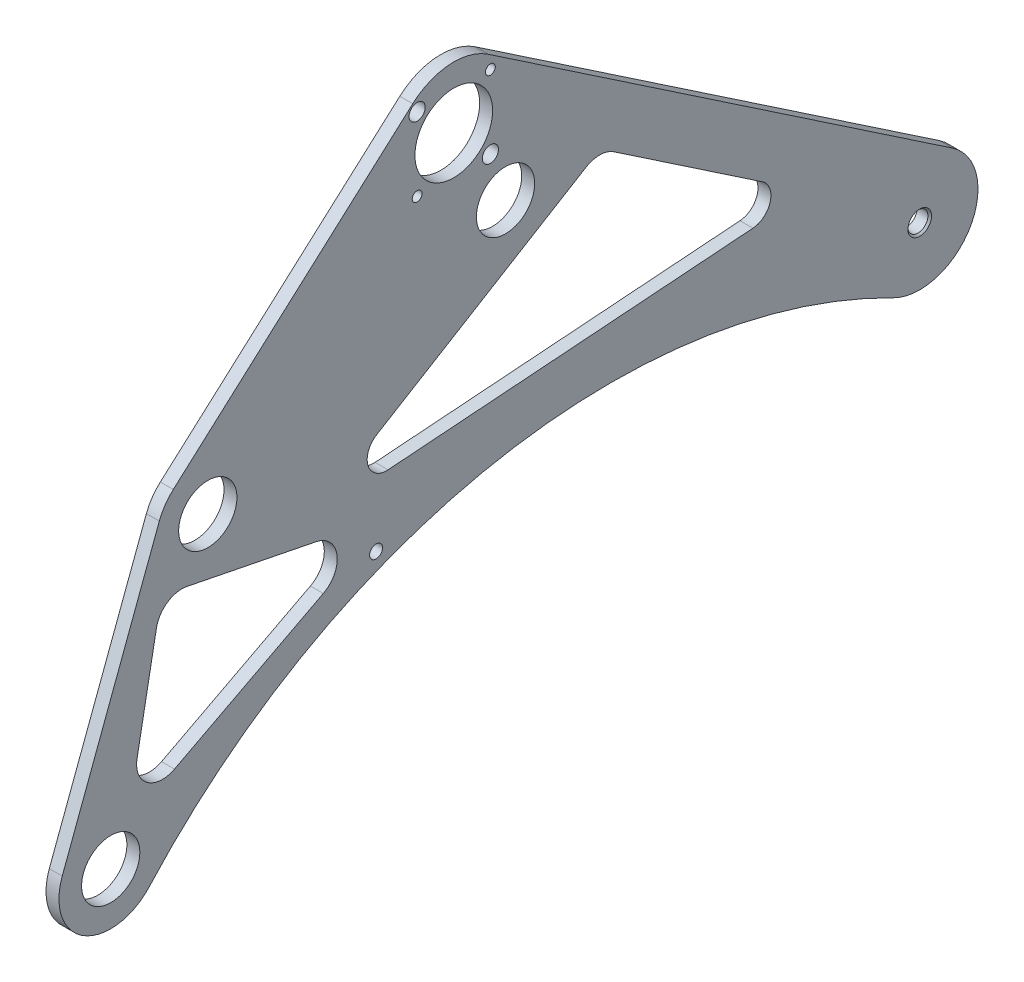
ISO-10303-21;
HEADER;
FILE_DESCRIPTION(('STEP AP214'),'2;1');
FILE_NAME('part.step','',(''),(''),'','','');
FILE_SCHEMA(('AUTOMOTIVE_DESIGN { 1 0 10303 214 1 1 1 1 }'));
ENDSEC;
DATA;
#1=APPLICATION_CONTEXT('core data for automotive mechanical design processes');
#2=APPLICATION_PROTOCOL_DEFINITION('international standard','automotive_design',2000,#1);
#3=PRODUCT_CONTEXT('',#1,'mechanical');
#4=PRODUCT('Part','Part','',(#3));
#5=PRODUCT_RELATED_PRODUCT_CATEGORY('part','',(#4));
#6=PRODUCT_DEFINITION_FORMATION('','',#4);
#7=PRODUCT_DEFINITION_CONTEXT('part definition',#1,'design');
#8=PRODUCT_DEFINITION('design','',#6,#7);
#9=PRODUCT_DEFINITION_SHAPE('','',#8);
#10=(LENGTH_UNIT() NAMED_UNIT(*) SI_UNIT(.MILLI.,.METRE.));
#11=(NAMED_UNIT(*) PLANE_ANGLE_UNIT() SI_UNIT($,.RADIAN.));
#12=(NAMED_UNIT(*) SI_UNIT($,.STERADIAN.) SOLID_ANGLE_UNIT());
#13=UNCERTAINTY_MEASURE_WITH_UNIT(LENGTH_MEASURE(1.E-05),#10,'distance_accuracy_value','');
#14=(GEOMETRIC_REPRESENTATION_CONTEXT(3) GLOBAL_UNCERTAINTY_ASSIGNED_CONTEXT((#13)) GLOBAL_UNIT_ASSIGNED_CONTEXT((#10,
#11,#12)) REPRESENTATION_CONTEXT('',''));
#15=CARTESIAN_POINT('',(0.,0.,0.));
#16=DIRECTION('',(0.,0.,1.));
#17=DIRECTION('',(1.,0.,0.));
#18=AXIS2_PLACEMENT_3D('',#15,#16,#17);
#19=CARTESIAN_POINT('',(6.35,0.,0.));
#20=DIRECTION('',(-1.,0.,0.));
#21=DIRECTION('',(0.,0.,1.));
#22=AXIS2_PLACEMENT_3D('',#19,#20,#21);
#23=CYLINDRICAL_SURFACE('',#22,28.575);
#24=CARTESIAN_POINT('',(0.,0.,0.));
#25=DIRECTION('',(1.,0.,0.));
#26=DIRECTION('',(0.,0.,-1.));
#27=AXIS2_PLACEMENT_3D('',#24,#25,#26);
#28=CIRCLE('',#27,28.575);
#29=CARTESIAN_POINT('',(0.,-25.4592346242806,12.9752840949953));
#30=VERTEX_POINT('',#29);
#31=CARTESIAN_POINT('',(0.,23.6838537199384,-15.9876733132923));
#32=VERTEX_POINT('',#31);
#33=EDGE_CURVE('E412',#30,#32,#28,.T.);
#34=ORIENTED_EDGE('',*,*,#33,.T.);
#35=DIRECTION('',(-1.,0.,0.));
#36=VECTOR('',#35,1.);
#37=CARTESIAN_POINT('',(6.35,23.6838537199384,-15.9876733132923));
#38=LINE('',#37,#36);
#39=CARTESIAN_POINT('',(6.35,23.6838537199384,-15.9876733132923));
#40=VERTEX_POINT('',#39);
#41=EDGE_CURVE('E11',#40,#32,#38,.T.);
#42=ORIENTED_EDGE('',*,*,#41,.F.);
#43=CARTESIAN_POINT('',(6.35,0.,0.));
#44=DIRECTION('',(1.,0.,0.));
#45=DIRECTION('',(0.,0.,-1.));
#46=AXIS2_PLACEMENT_3D('',#43,#44,#45);
#47=CIRCLE('',#46,28.575);
#48=CARTESIAN_POINT('',(6.35,-25.4592346242806,12.9752840949953));
#49=VERTEX_POINT('',#48);
#50=EDGE_CURVE('E413',#49,#40,#47,.T.);
#51=ORIENTED_EDGE('',*,*,#50,.F.);
#52=DIRECTION('',(-1.,0.,0.));
#53=VECTOR('',#52,1.);
#54=CARTESIAN_POINT('',(6.35,-25.4592346242806,12.9752840949953));
#55=LINE('',#54,#53);
#56=EDGE_CURVE('E436',#49,#30,#55,.T.);
#57=ORIENTED_EDGE('',*,*,#56,.T.);
#58=EDGE_LOOP('',(#34,#42,#51,#57));
#59=FACE_BOUND('',#58,.T.);
#60=ADVANCED_FACE('F41',(#59),#23,.T.);
#61=CARTESIAN_POINT('',(6.35,177.399623371046,211.724122613747));
#62=DIRECTION('',(0.,-0.828831276288309,0.559498628636651));
#63=DIRECTION('',(0.,-0.559498628636651,-0.828831276288309));
#64=AXIS2_PLACEMENT_3D('',#61,#62,#63);
#65=PLANE('',#64);
#66=DIRECTION('',(0.,0.559498628636651,0.828831276288309));
#67=VECTOR('',#66,1.);
#68=CARTESIAN_POINT('',(0.,177.399623371046,211.724122613747));
#69=LINE('',#68,#67);
#70=CARTESIAN_POINT('',(0.,177.399623371046,211.724122613747));
#71=VERTEX_POINT('',#70);
#72=EDGE_CURVE('E440',#32,#71,#69,.T.);
#73=ORIENTED_EDGE('',*,*,#72,.T.);
#74=DIRECTION('',(-1.,0.,0.));
#75=VECTOR('',#74,1.);
#76=CARTESIAN_POINT('',(6.35,177.399623371046,211.724122613747));
#77=LINE('',#76,#75);
#78=CARTESIAN_POINT('',(6.35,177.399623371046,211.724122613747));
#79=VERTEX_POINT('',#78);
#80=EDGE_CURVE('E48',#79,#71,#77,.T.);
#81=ORIENTED_EDGE('',*,*,#80,.F.);
#82=DIRECTION('',(0.,0.559498628636651,0.828831276288309));
#83=VECTOR('',#82,1.);
#84=CARTESIAN_POINT('',(6.35,177.399623371046,211.724122613747));
#85=LINE('',#84,#83);
#86=EDGE_CURVE('E417',#40,#79,#85,.T.);
#87=ORIENTED_EDGE('',*,*,#86,.F.);
#88=ORIENTED_EDGE('',*,*,#41,.T.);
#89=EDGE_LOOP('',(#73,#81,#87,#88));
#90=FACE_BOUND('',#89,.T.);
#91=ADVANCED_FACE('F502',(#90),#65,.F.);
#92=CARTESIAN_POINT('',(6.35,152.4,228.6));
#93=DIRECTION('',(-1.,0.,0.));
#94=DIRECTION('',(0.,0.,1.));
#95=AXIS2_PLACEMENT_3D('',#92,#93,#94);
#96=CYLINDRICAL_SURFACE('',#95,30.1625);
#97=CARTESIAN_POINT('',(0.,152.4,228.6));
#98=DIRECTION('',(1.,0.,0.));
#99=DIRECTION('',(0.,0.,-1.));
#100=AXIS2_PLACEMENT_3D('',#97,#98,#99);
#101=CIRCLE('',#100,30.1625);
#102=CARTESIAN_POINT('',(0.,174.87448591487,248.71650787568));
#103=VERTEX_POINT('',#102);
#104=EDGE_CURVE('E443',#71,#103,#101,.T.);
#105=ORIENTED_EDGE('',*,*,#104,.T.);
#106=DIRECTION('',(-1.,0.,0.));
#107=VECTOR('',#106,1.);
#108=CARTESIAN_POINT('',(6.35,174.87448591487,248.71650787568));
#109=LINE('',#108,#107);
#110=CARTESIAN_POINT('',(6.35,174.87448591487,248.71650787568));
#111=VERTEX_POINT('',#110);
#112=EDGE_CURVE('E472',#111,#103,#109,.T.);
#113=ORIENTED_EDGE('',*,*,#112,.F.);
#114=CARTESIAN_POINT('',(6.35,152.4,228.6));
#115=DIRECTION('',(1.,0.,0.));
#116=DIRECTION('',(0.,0.,-1.));
#117=AXIS2_PLACEMENT_3D('',#114,#115,#116);
#118=CIRCLE('',#117,30.1625);
#119=EDGE_CURVE('E421',#79,#111,#118,.T.);
#120=ORIENTED_EDGE('',*,*,#119,.F.);
#121=ORIENTED_EDGE('',*,*,#80,.T.);
#122=EDGE_LOOP('',(#105,#113,#120,#121));
#123=FACE_BOUND('',#122,.T.);
#124=ADVANCED_FACE('F480',(#123),#96,.T.);
#125=CARTESIAN_POINT('',(6.35,69.7258828756801,366.190217158467));
#126=DIRECTION('',(0.,-0.745113499042526,-0.666937683404232));
#127=DIRECTION('',(0.,0.666937683404232,-0.745113499042526));
#128=AXIS2_PLACEMENT_3D('',#125,#126,#127);
#129=PLANE('',#128);
#130=DIRECTION('',(0.,-0.666937683404232,0.745113499042526));
#131=VECTOR('',#130,1.);
#132=CARTESIAN_POINT('',(0.,69.7258828756801,366.190217158467));
#133=LINE('',#132,#131);
#134=CARTESIAN_POINT('',(0.,69.7258828756801,366.190217158467));
#135=VERTEX_POINT('',#134);
#136=EDGE_CURVE('E446',#103,#135,#133,.T.);
#137=ORIENTED_EDGE('',*,*,#136,.T.);
#138=DIRECTION('',(-1.,0.,0.));
#139=VECTOR('',#138,1.);
#140=CARTESIAN_POINT('',(6.35,69.7258828756801,366.190217158467));
#141=LINE('',#140,#139);
#142=CARTESIAN_POINT('',(6.35,69.7258828756801,366.190217158467));
#143=VERTEX_POINT('',#142);
#144=EDGE_CURVE('E469',#143,#135,#141,.T.);
#145=ORIENTED_EDGE('',*,*,#144,.F.);
#146=DIRECTION('',(0.,-0.666937683404232,0.745113499042526));
#147=VECTOR('',#146,1.);
#148=CARTESIAN_POINT('',(6.35,69.7258828756801,366.190217158467));
#149=LINE('',#148,#147);
#150=EDGE_CURVE('E424',#111,#143,#149,.T.);
#151=ORIENTED_EDGE('',*,*,#150,.F.);
#152=ORIENTED_EDGE('',*,*,#112,.T.);
#153=EDGE_LOOP('',(#137,#145,#151,#152));
#154=FACE_BOUND('',#153,.T.);
#155=ADVANCED_FACE('F490',(#154),#129,.F.);
#156=CARTESIAN_POINT('',(6.35,50.8,349.25));
#157=DIRECTION('',(-1.,0.,0.));
#158=DIRECTION('',(0.,0.,1.));
#159=AXIS2_PLACEMENT_3D('',#156,#157,#158);
#160=CYLINDRICAL_SURFACE('',#159,25.3999999999999);
#161=CARTESIAN_POINT('',(0.,50.8,349.25));
#162=DIRECTION('',(1.,0.,0.));
#163=DIRECTION('',(0.,0.,-1.));
#164=AXIS2_PLACEMENT_3D('',#161,#162,#163);
#165=CIRCLE('',#164,25.3999999999999);
#166=CARTESIAN_POINT('',(0.,59.7185354163451,373.032761110254));
#167=VERTEX_POINT('',#166);
#168=EDGE_CURVE('E448',#135,#167,#165,.T.);
#169=ORIENTED_EDGE('',*,*,#168,.T.);
#170=DIRECTION('',(-1.,0.,0.));
#171=VECTOR('',#170,1.);
#172=CARTESIAN_POINT('',(6.35,59.7185354163451,373.032761110254));
#173=LINE('',#172,#171);
#174=CARTESIAN_POINT('',(6.35,59.7185354163451,373.032761110254));
#175=VERTEX_POINT('',#174);
#176=EDGE_CURVE('E466',#175,#167,#173,.T.);
#177=ORIENTED_EDGE('',*,*,#176,.F.);
#178=CARTESIAN_POINT('',(6.35,50.8,349.25));
#179=DIRECTION('',(1.,0.,0.));
#180=DIRECTION('',(0.,0.,-1.));
#181=AXIS2_PLACEMENT_3D('',#178,#179,#180);
#182=CIRCLE('',#181,25.3999999999999);
#183=EDGE_CURVE('E426',#143,#175,#182,.T.);
#184=ORIENTED_EDGE('',*,*,#183,.F.);
#185=ORIENTED_EDGE('',*,*,#144,.T.);
#186=EDGE_LOOP('',(#169,#177,#184,#185));
#187=FACE_BOUND('',#186,.T.);
#188=ADVANCED_FACE('F494',(#187),#160,.T.);
#189=CARTESIAN_POINT('',(6.35,-67.2814645836549,420.657761110254));
#190=DIRECTION('',(0.,-0.351123441588392,-0.936329177569044));
#191=DIRECTION('',(0.,0.936329177569045,-0.351123441588392));
#192=AXIS2_PLACEMENT_3D('',#189,#190,#191);
#193=PLANE('',#192);
#194=DIRECTION('',(0.,-0.936329177569045,0.351123441588392));
#195=VECTOR('',#194,1.);
#196=CARTESIAN_POINT('',(0.,-67.2814645836549,420.657761110254));
#197=LINE('',#196,#195);
#198=CARTESIAN_POINT('',(0.,-67.2814645836549,420.657761110254));
#199=VERTEX_POINT('',#198);
#200=EDGE_CURVE('E450',#167,#199,#197,.T.);
#201=ORIENTED_EDGE('',*,*,#200,.T.);
#202=DIRECTION('',(-1.,0.,0.));
#203=VECTOR('',#202,1.);
#204=CARTESIAN_POINT('',(6.35,-67.2814645836549,420.657761110254));
#205=LINE('',#204,#203);
#206=CARTESIAN_POINT('',(6.35,-67.2814645836549,420.657761110254));
#207=VERTEX_POINT('',#206);
#208=EDGE_CURVE('E463',#207,#199,#205,.T.);
#209=ORIENTED_EDGE('',*,*,#208,.F.);
#210=DIRECTION('',(0.,-0.936329177569045,0.351123441588392));
#211=VECTOR('',#210,1.);
#212=CARTESIAN_POINT('',(6.35,-67.2814645836549,420.657761110254));
#213=LINE('',#212,#211);
#214=EDGE_CURVE('E428',#175,#207,#213,.T.);
#215=ORIENTED_EDGE('',*,*,#214,.F.);
#216=ORIENTED_EDGE('',*,*,#176,.T.);
#217=EDGE_LOOP('',(#201,#209,#215,#216));
#218=FACE_BOUND('',#217,.T.);
#219=ADVANCED_FACE('F515',(#218),#193,.F.);
#220=CARTESIAN_POINT('',(6.35,-76.2,396.875));
#221=DIRECTION('',(-1.,0.,0.));
#222=DIRECTION('',(0.,0.,1.));
#223=AXIS2_PLACEMENT_3D('',#220,#221,#222);
#224=CYLINDRICAL_SURFACE('',#223,25.4);
#225=CARTESIAN_POINT('',(0.,-76.2,396.875));
#226=DIRECTION('',(1.,0.,0.));
#227=DIRECTION('',(0.,0.,-1.));
#228=AXIS2_PLACEMENT_3D('',#225,#226,#227);
#229=CIRCLE('',#228,25.4);
#230=CARTESIAN_POINT('',(0.,-93.1864926115338,377.990639572432));
#231=VERTEX_POINT('',#230);
#232=EDGE_CURVE('E453',#199,#231,#229,.T.);
#233=ORIENTED_EDGE('',*,*,#232,.T.);
#234=DIRECTION('',(-1.,0.,0.));
#235=VECTOR('',#234,1.);
#236=CARTESIAN_POINT('',(6.35,-93.1864926115338,377.990639572432));
#237=LINE('',#236,#235);
#238=CARTESIAN_POINT('',(6.35,-93.1864926115338,377.990639572432));
#239=VERTEX_POINT('',#238);
#240=EDGE_CURVE('E460',#239,#231,#237,.T.);
#241=ORIENTED_EDGE('',*,*,#240,.F.);
#242=CARTESIAN_POINT('',(6.35,-76.2,396.875));
#243=DIRECTION('',(1.,0.,0.));
#244=DIRECTION('',(0.,0.,-1.));
#245=AXIS2_PLACEMENT_3D('',#242,#243,#244);
#246=CIRCLE('',#245,25.4);
#247=EDGE_CURVE('E431',#207,#239,#246,.T.);
#248=ORIENTED_EDGE('',*,*,#247,.F.);
#249=ORIENTED_EDGE('',*,*,#208,.T.);
#250=EDGE_LOOP('',(#233,#241,#248,#249));
#251=FACE_BOUND('',#250,.T.);
#252=ADVANCED_FACE('F513',(#251),#224,.T.);
#253=CARTESIAN_POINT('',(6.35,-297.024403949939,151.378314441612));
#254=DIRECTION('',(-1.,0.,0.));
#255=DIRECTION('',(0.,0.,1.));
#256=AXIS2_PLACEMENT_3D('',#253,#254,#255);
#257=CYLINDRICAL_SURFACE('',#256,304.8);
#258=CARTESIAN_POINT('',(0.,-297.024403949939,151.378314441612));
#259=DIRECTION('',(-1.,0.,0.));
#260=DIRECTION('',(0.,0.,1.));
#261=AXIS2_PLACEMENT_3D('',#258,#259,#260);
#262=CIRCLE('',#261,304.8);
#263=EDGE_CURVE('E418',#231,#30,#262,.T.);
#264=ORIENTED_EDGE('',*,*,#263,.T.);
#265=ORIENTED_EDGE('',*,*,#56,.F.);
#266=CARTESIAN_POINT('',(6.35,-297.024403949939,151.378314441612));
#267=DIRECTION('',(-1.,0.,0.));
#268=DIRECTION('',(0.,0.,1.));
#269=AXIS2_PLACEMENT_3D('',#266,#267,#268);
#270=CIRCLE('',#269,304.8);
#271=EDGE_CURVE('E433',#239,#49,#270,.T.);
#272=ORIENTED_EDGE('',*,*,#271,.F.);
#273=ORIENTED_EDGE('',*,*,#240,.T.);
#274=EDGE_LOOP('',(#264,#265,#272,#273));
#275=FACE_BOUND('',#274,.T.);
#276=ADVANCED_FACE('F508',(#275),#257,.F.);
#277=CARTESIAN_POINT('',(6.35,0.,0.));
#278=DIRECTION('',(1.,0.,0.));
#279=DIRECTION('',(0.,0.,-1.));
#280=AXIS2_PLACEMENT_3D('',#277,#278,#279);
#281=PLANE('',#280);
#282=CARTESIAN_POINT('',(6.35,12.7,361.95));
#283=DIRECTION('',(1.,0.,0.));
#284=DIRECTION('',(0.,0.,-1.));
#285=AXIS2_PLACEMENT_3D('',#282,#283,#284);
#286=CIRCLE('',#285,12.7);
#287=CARTESIAN_POINT('',(6.35,25.1533745812747,359.459325083745));
#288=VERTEX_POINT('',#287);
#289=CARTESIAN_POINT('',(6.35,15.0404643951374,374.432476774066));
#290=VERTEX_POINT('',#289);
#291=EDGE_CURVE('E58',#288,#290,#286,.T.);
#292=ORIENTED_EDGE('',*,*,#291,.F.);
#293=DIRECTION('',(0.,0.196116135138184,0.98058067569092));
#294=VECTOR('',#293,1.);
#295=CARTESIAN_POINT('',(6.35,12.4533745812747,295.959325083745));
#296=LINE('',#295,#294);
#297=CARTESIAN_POINT('',(6.35,12.4533745812747,295.959325083745));
#298=VERTEX_POINT('',#297);
#299=EDGE_CURVE('E225',#298,#288,#296,.T.);
#300=ORIENTED_EDGE('',*,*,#299,.F.);
#301=CARTESIAN_POINT('',(6.35,0.,298.45));
#302=DIRECTION('',(1.,0.,0.));
#303=DIRECTION('',(0.,0.,-1.));
#304=AXIS2_PLACEMENT_3D('',#301,#302,#303);
#305=CIRCLE('',#304,12.7);
#306=CARTESIAN_POINT('',(6.35,-11.2596275463013,292.575411714973));
#307=VERTEX_POINT('',#306);
#308=EDGE_CURVE('E229',#307,#298,#305,.T.);
#309=ORIENTED_EDGE('',*,*,#308,.F.);
#310=DIRECTION('',(0.,0.46256600669502,-0.886584846165455));
#311=VECTOR('',#310,1.);
#312=CARTESIAN_POINT('',(6.35,-49.3596275463013,365.600411714973));
#313=LINE('',#312,#311);
#314=CARTESIAN_POINT('',(6.35,-49.3596275463013,365.600411714973));
#315=VERTEX_POINT('',#314);
#316=EDGE_CURVE('E253',#315,#307,#313,.T.);
#317=ORIENTED_EDGE('',*,*,#316,.F.);
#318=CARTESIAN_POINT('',(6.35,-38.1,371.475));
#319=DIRECTION('',(1.,0.,0.));
#320=DIRECTION('',(0.,0.,-1.));
#321=AXIS2_PLACEMENT_3D('',#318,#319,#320);
#322=CIRCLE('',#321,12.7);
#323=CARTESIAN_POINT('',(6.35,-35.7595356048627,383.957476774066));
#324=VERTEX_POINT('',#323);
#325=EDGE_CURVE('E249',#324,#315,#322,.T.);
#326=ORIENTED_EDGE('',*,*,#325,.F.);
#327=DIRECTION('',(0.,-0.982872186934322,0.184288535050185));
#328=VECTOR('',#327,1.);
#329=CARTESIAN_POINT('',(6.35,15.0404643951374,374.432476774066));
#330=LINE('',#329,#328);
#331=EDGE_CURVE('E245',#290,#324,#330,.T.);
#332=ORIENTED_EDGE('',*,*,#331,.F.);
#333=EDGE_LOOP('',(#292,#300,#309,#317,#326,#332));
#334=FACE_BOUND('',#333,.T.);
#335=CARTESIAN_POINT('',(6.35,34.8993800067274,261.535595289291));
#336=DIRECTION('',(1.,0.,0.));
#337=DIRECTION('',(0.,0.,1.));
#338=AXIS2_PLACEMENT_3D('',#335,#336,#337);
#339=CIRCLE('',#338,9.52500000000002);
#340=CARTESIAN_POINT('',(6.35,43.04361786909,266.474928710033));
#341=VERTEX_POINT('',#340);
#342=CARTESIAN_POINT('',(6.35,25.4,260.837451688168));
#343=VERTEX_POINT('',#342);
#344=EDGE_CURVE('E66',#341,#343,#339,.T.);
#345=ORIENTED_EDGE('',*,*,#344,.F.);
#346=DIRECTION('',(0.,-0.518565188529348,0.855038095786101));
#347=VECTOR('',#346,1.);
#348=CARTESIAN_POINT('',(6.35,105.399060820125,163.659929974856));
#349=LINE('',#348,#347);
#350=CARTESIAN_POINT('',(6.35,105.399060820125,163.659929974856));
#351=VERTEX_POINT('',#350);
#352=EDGE_CURVE('E279',#351,#341,#349,.T.);
#353=ORIENTED_EDGE('',*,*,#352,.F.);
#354=CARTESIAN_POINT('',(6.35,94.5400770036413,157.074152080533));
#355=DIRECTION('',(1.,0.,0.));
#356=DIRECTION('',(0.,0.,-1.));
#357=AXIS2_PLACEMENT_3D('',#354,#355,#356);
#358=CIRCLE('',#357,12.7);
#359=CARTESIAN_POINT('',(6.35,105.066234212503,149.968519496848));
#360=VERTEX_POINT('',#359);
#361=EDGE_CURVE('E313',#360,#351,#358,.T.);
#362=ORIENTED_EDGE('',*,*,#361,.F.);
#363=DIRECTION('',(0.,0.559498628636651,0.828831276288309));
#364=VECTOR('',#363,1.);
#365=CARTESIAN_POINT('',(6.35,55.9492671109962,77.2075216203181));
#366=LINE('',#365,#364);
#367=CARTESIAN_POINT('',(6.35,55.9492671109962,77.2075216203181));
#368=VERTEX_POINT('',#367);
#369=EDGE_CURVE('E309',#368,#360,#366,.T.);
#370=ORIENTED_EDGE('',*,*,#369,.F.);
#371=CARTESIAN_POINT('',(6.35,48.0546492043499,82.536746058082));
#372=DIRECTION('',(1.,0.,0.));
#373=DIRECTION('',(0.,0.,-1.));
#374=AXIS2_PLACEMENT_3D('',#371,#372,#373);
#375=CIRCLE('',#374,9.52500000000001);
#376=CARTESIAN_POINT('',(6.35,38.5552691976225,81.83860245696));
#377=VERTEX_POINT('',#376);
#378=EDGE_CURVE('E305',#377,#368,#375,.T.);
#379=ORIENTED_EDGE('',*,*,#378,.F.);
#380=DIRECTION('',(0.,0.0732959161283184,-0.99731023692676));
#381=VECTOR('',#380,1.);
#382=CARTESIAN_POINT('',(6.35,25.4,260.837451688168));
#383=LINE('',#382,#381);
#384=EDGE_CURVE('E301',#343,#377,#383,.T.);
#385=ORIENTED_EDGE('',*,*,#384,.F.);
#386=EDGE_LOOP('',(#345,#353,#362,#370,#379,#385));
#387=FACE_BOUND('',#386,.T.);
#388=CARTESIAN_POINT('',(6.35,-6.35,266.7));
#389=DIRECTION('',(1.,0.,0.));
#390=DIRECTION('',(0.,0.,-1.));
#391=AXIS2_PLACEMENT_3D('',#388,#389,#390);
#392=CIRCLE('',#391,3.175);
#393=CARTESIAN_POINT('',(6.35,-6.35,263.525));
#394=VERTEX_POINT('',#393);
#395=EDGE_CURVE('E263',#394,#394,#392,.T.);
#396=ORIENTED_EDGE('',*,*,#395,.F.);
#397=EDGE_LOOP('',(#396));
#398=FACE_BOUND('',#397,.T.);
#399=CARTESIAN_POINT('',(6.35,0.,0.));
#400=DIRECTION('',(1.,0.,0.));
#401=DIRECTION('',(0.,0.,-1.));
#402=AXIS2_PLACEMENT_3D('',#399,#400,#401);
#403=CIRCLE('',#402,5.79374);
#404=CARTESIAN_POINT('',(6.35,0.,-5.79374));
#405=VERTEX_POINT('',#404);
#406=EDGE_CURVE('E339',#405,#405,#403,.T.);
#407=ORIENTED_EDGE('',*,*,#406,.F.);
#408=EDGE_LOOP('',(#407));
#409=FACE_BOUND('',#408,.T.);
#410=CARTESIAN_POINT('',(6.35,50.8,349.25));
#411=DIRECTION('',(1.,0.,0.));
#412=DIRECTION('',(0.,0.,-1.));
#413=AXIS2_PLACEMENT_3D('',#410,#411,#412);
#414=CIRCLE('',#413,14.2875);
#415=CARTESIAN_POINT('',(6.35,50.8,334.9625));
#416=VERTEX_POINT('',#415);
#417=EDGE_CURVE('E375',#416,#416,#414,.T.);
#418=ORIENTED_EDGE('',*,*,#417,.F.);
#419=EDGE_LOOP('',(#418));
#420=FACE_BOUND('',#419,.T.);
#421=CARTESIAN_POINT('',(6.35,-76.2,396.875));
#422=DIRECTION('',(1.,0.,0.));
#423=DIRECTION('',(0.,0.,-1.));
#424=AXIS2_PLACEMENT_3D('',#421,#422,#423);
#425=CIRCLE('',#424,14.2875);
#426=CARTESIAN_POINT('',(6.35,-76.2,382.5875));
#427=VERTEX_POINT('',#426);
#428=EDGE_CURVE('E385',#427,#427,#425,.T.);
#429=ORIENTED_EDGE('',*,*,#428,.F.);
#430=EDGE_LOOP('',(#429));
#431=FACE_BOUND('',#430,.T.);
#432=CARTESIAN_POINT('',(6.35,134.439487757862,246.560512242138));
#433=DIRECTION('',(1.,0.,0.));
#434=DIRECTION('',(0.,0.,-1.));
#435=AXIS2_PLACEMENT_3D('',#432,#433,#434);
#436=CIRCLE('',#435,2.41300000000034);
#437=CARTESIAN_POINT('',(6.35,134.439487757862,244.147512242138));
#438=VERTEX_POINT('',#437);
#439=EDGE_CURVE('E361',#438,#438,#436,.T.);
#440=ORIENTED_EDGE('',*,*,#439,.F.);
#441=EDGE_LOOP('',(#440));
#442=FACE_BOUND('',#441,.T.);
#443=CARTESIAN_POINT('',(6.35,152.4,228.6));
#444=DIRECTION('',(1.,0.,0.));
#445=DIRECTION('',(0.,0.,-1.));
#446=AXIS2_PLACEMENT_3D('',#443,#444,#445);
#447=CIRCLE('',#446,19.05);
#448=CARTESIAN_POINT('',(6.35,152.4,209.55));
#449=VERTEX_POINT('',#448);
#450=EDGE_CURVE('E398',#449,#449,#447,.T.);
#451=ORIENTED_EDGE('',*,*,#450,.F.);
#452=EDGE_LOOP('',(#451));
#453=FACE_BOUND('',#452,.T.);
#454=CARTESIAN_POINT('',(6.35,170.360512242138,210.639487757862));
#455=DIRECTION('',(1.,0.,0.));
#456=DIRECTION('',(0.,0.,-1.));
#457=AXIS2_PLACEMENT_3D('',#454,#455,#456);
#458=CIRCLE('',#457,2.41300000000031);
#459=CARTESIAN_POINT('',(6.35,170.360512242138,208.226487757862));
#460=VERTEX_POINT('',#459);
#461=EDGE_CURVE('E352',#460,#460,#458,.T.);
#462=ORIENTED_EDGE('',*,*,#461,.F.);
#463=EDGE_LOOP('',(#462));
#464=FACE_BOUND('',#463,.T.);
#465=CARTESIAN_POINT('',(6.35,170.360512242138,246.560512242138));
#466=DIRECTION('',(1.,0.,0.));
#467=DIRECTION('',(0.,0.,-1.));
#468=AXIS2_PLACEMENT_3D('',#465,#466,#467);
#469=CIRCLE('',#468,3.96874999999999);
#470=CARTESIAN_POINT('',(6.35,170.360512242138,242.591762242138));
#471=VERTEX_POINT('',#470);
#472=EDGE_CURVE('E362',#471,#471,#469,.T.);
#473=ORIENTED_EDGE('',*,*,#472,.F.);
#474=EDGE_LOOP('',(#473));
#475=FACE_BOUND('',#474,.T.);
#476=CARTESIAN_POINT('',(6.35,134.439487757862,210.639487757862));
#477=DIRECTION('',(1.,0.,0.));
#478=DIRECTION('',(0.,0.,-1.));
#479=AXIS2_PLACEMENT_3D('',#476,#477,#478);
#480=CIRCLE('',#479,3.96874999999999);
#481=CARTESIAN_POINT('',(6.35,134.439487757862,206.670737757862));
#482=VERTEX_POINT('',#481);
#483=EDGE_CURVE('E351',#482,#482,#480,.T.);
#484=ORIENTED_EDGE('',*,*,#483,.F.);
#485=EDGE_LOOP('',(#484));
#486=FACE_BOUND('',#485,.T.);
#487=CARTESIAN_POINT('',(6.35,111.125,203.2));
#488=DIRECTION('',(1.,0.,0.));
#489=DIRECTION('',(0.,0.,-1.));
#490=AXIS2_PLACEMENT_3D('',#487,#488,#489);
#491=CIRCLE('',#490,14.2875);
#492=CARTESIAN_POINT('',(6.35,111.125,188.9125));
#493=VERTEX_POINT('',#492);
#494=EDGE_CURVE('E384',#493,#493,#491,.T.);
#495=ORIENTED_EDGE('',*,*,#494,.F.);
#496=EDGE_LOOP('',(#495));
#497=FACE_BOUND('',#496,.T.);
#498=ORIENTED_EDGE('',*,*,#50,.T.);
#499=ORIENTED_EDGE('',*,*,#86,.T.);
#500=ORIENTED_EDGE('',*,*,#119,.T.);
#501=ORIENTED_EDGE('',*,*,#150,.T.);
#502=ORIENTED_EDGE('',*,*,#183,.T.);
#503=ORIENTED_EDGE('',*,*,#214,.T.);
#504=ORIENTED_EDGE('',*,*,#247,.T.);
#505=ORIENTED_EDGE('',*,*,#271,.T.);
#506=EDGE_LOOP('',(#498,#499,#500,#501,#502,#503,#504,#505));
#507=FACE_BOUND('',#506,.T.);
#508=ADVANCED_FACE('F498',(#334,#387,#398,#409,#420,#431,#442,#453,#464,#475,#486,#497,#507),
#281,.T.);
#509=CARTESIAN_POINT('',(0.,0.,0.));
#510=DIRECTION('',(1.,0.,0.));
#511=DIRECTION('',(0.,0.,-1.));
#512=AXIS2_PLACEMENT_3D('',#509,#510,#511);
#513=PLANE('',#512);
#514=DIRECTION('',(0.,0.196116135138184,0.98058067569092));
#515=VECTOR('',#514,1.);
#516=CARTESIAN_POINT('',(0.,12.4533745812747,295.959325083745));
#517=LINE('',#516,#515);
#518=CARTESIAN_POINT('',(0.,12.4533745812747,295.959325083745));
#519=VERTEX_POINT('',#518);
#520=CARTESIAN_POINT('',(0.,25.1533745812747,359.459325083745));
#521=VERTEX_POINT('',#520);
#522=EDGE_CURVE('E209',#519,#521,#517,.T.);
#523=ORIENTED_EDGE('',*,*,#522,.T.);
#524=CARTESIAN_POINT('',(0.,12.7,361.95));
#525=DIRECTION('',(1.,0.,0.));
#526=DIRECTION('',(0.,0.,-1.));
#527=AXIS2_PLACEMENT_3D('',#524,#525,#526);
#528=CIRCLE('',#527,12.7);
#529=CARTESIAN_POINT('',(0.,15.0404643951374,374.432476774066));
#530=VERTEX_POINT('',#529);
#531=EDGE_CURVE('E202',#521,#530,#528,.T.);
#532=ORIENTED_EDGE('',*,*,#531,.T.);
#533=DIRECTION('',(0.,-0.982872186934322,0.184288535050185));
#534=VECTOR('',#533,1.);
#535=CARTESIAN_POINT('',(0.,15.0404643951374,374.432476774066));
#536=LINE('',#535,#534);
#537=CARTESIAN_POINT('',(0.,-35.7595356048627,383.957476774066));
#538=VERTEX_POINT('',#537);
#539=EDGE_CURVE('E213',#530,#538,#536,.T.);
#540=ORIENTED_EDGE('',*,*,#539,.T.);
#541=CARTESIAN_POINT('',(0.,-38.1,371.475));
#542=DIRECTION('',(1.,0.,0.));
#543=DIRECTION('',(0.,0.,-1.));
#544=AXIS2_PLACEMENT_3D('',#541,#542,#543);
#545=CIRCLE('',#544,12.7);
#546=CARTESIAN_POINT('',(0.,-49.3596275463013,365.600411714973));
#547=VERTEX_POINT('',#546);
#548=EDGE_CURVE('E218',#538,#547,#545,.T.);
#549=ORIENTED_EDGE('',*,*,#548,.T.);
#550=DIRECTION('',(0.,0.46256600669502,-0.886584846165455));
#551=VECTOR('',#550,1.);
#552=CARTESIAN_POINT('',(0.,-49.3596275463013,365.600411714973));
#553=LINE('',#552,#551);
#554=CARTESIAN_POINT('',(0.,-11.2596275463013,292.575411714973));
#555=VERTEX_POINT('',#554);
#556=EDGE_CURVE('E234',#547,#555,#553,.T.);
#557=ORIENTED_EDGE('',*,*,#556,.T.);
#558=CARTESIAN_POINT('',(0.,0.,298.45));
#559=DIRECTION('',(1.,0.,0.));
#560=DIRECTION('',(0.,0.,-1.));
#561=AXIS2_PLACEMENT_3D('',#558,#559,#560);
#562=CIRCLE('',#561,12.7);
#563=EDGE_CURVE('E238',#555,#519,#562,.T.);
#564=ORIENTED_EDGE('',*,*,#563,.T.);
#565=EDGE_LOOP('',(#523,#532,#540,#549,#557,#564));
#566=FACE_BOUND('',#565,.T.);
#567=DIRECTION('',(0.,-0.518565188529348,0.855038095786101));
#568=VECTOR('',#567,1.);
#569=CARTESIAN_POINT('',(0.,105.399060820125,163.659929974856));
#570=LINE('',#569,#568);
#571=CARTESIAN_POINT('',(0.,105.399060820125,163.659929974856));
#572=VERTEX_POINT('',#571);
#573=CARTESIAN_POINT('',(0.,43.04361786909,266.474928710033));
#574=VERTEX_POINT('',#573);
#575=EDGE_CURVE('E295',#572,#574,#570,.T.);
#576=ORIENTED_EDGE('',*,*,#575,.T.);
#577=CARTESIAN_POINT('',(0.,34.8993800067274,261.535595289291));
#578=DIRECTION('',(1.,0.,0.));
#579=DIRECTION('',(0.,0.,1.));
#580=AXIS2_PLACEMENT_3D('',#577,#578,#579);
#581=CIRCLE('',#580,9.52500000000002);
#582=CARTESIAN_POINT('',(0.,25.4,260.837451688168));
#583=VERTEX_POINT('',#582);
#584=EDGE_CURVE('E275',#574,#583,#581,.T.);
#585=ORIENTED_EDGE('',*,*,#584,.T.);
#586=DIRECTION('',(0.,0.0732959161283184,-0.99731023692676));
#587=VECTOR('',#586,1.);
#588=CARTESIAN_POINT('',(0.,25.4,260.837451688168));
#589=LINE('',#588,#587);
#590=CARTESIAN_POINT('',(0.,38.5552691976225,81.83860245696));
#591=VERTEX_POINT('',#590);
#592=EDGE_CURVE('E278',#583,#591,#589,.T.);
#593=ORIENTED_EDGE('',*,*,#592,.T.);
#594=CARTESIAN_POINT('',(0.,48.0546492043499,82.536746058082));
#595=DIRECTION('',(1.,0.,0.));
#596=DIRECTION('',(0.,0.,-1.));
#597=AXIS2_PLACEMENT_3D('',#594,#595,#596);
#598=CIRCLE('',#597,9.52500000000001);
#599=CARTESIAN_POINT('',(0.,55.9492671109962,77.2075216203181));
#600=VERTEX_POINT('',#599);
#601=EDGE_CURVE('E283',#591,#600,#598,.T.);
#602=ORIENTED_EDGE('',*,*,#601,.T.);
#603=DIRECTION('',(0.,0.559498628636651,0.828831276288309));
#604=VECTOR('',#603,1.);
#605=CARTESIAN_POINT('',(0.,55.9492671109962,77.2075216203181));
#606=LINE('',#605,#604);
#607=CARTESIAN_POINT('',(0.,105.066234212503,149.968519496848));
#608=VERTEX_POINT('',#607);
#609=EDGE_CURVE('E287',#600,#608,#606,.T.);
#610=ORIENTED_EDGE('',*,*,#609,.T.);
#611=CARTESIAN_POINT('',(0.,94.5400770036413,157.074152080533));
#612=DIRECTION('',(1.,0.,0.));
#613=DIRECTION('',(0.,0.,-1.));
#614=AXIS2_PLACEMENT_3D('',#611,#612,#613);
#615=CIRCLE('',#614,12.7);
#616=EDGE_CURVE('E291',#608,#572,#615,.T.);
#617=ORIENTED_EDGE('',*,*,#616,.T.);
#618=EDGE_LOOP('',(#576,#585,#593,#602,#610,#617));
#619=FACE_BOUND('',#618,.T.);
#620=CARTESIAN_POINT('',(0.,-6.35,266.7));
#621=DIRECTION('',(1.,0.,0.));
#622=DIRECTION('',(0.,0.,-1.));
#623=AXIS2_PLACEMENT_3D('',#620,#621,#622);
#624=CIRCLE('',#623,3.175);
#625=CARTESIAN_POINT('',(0.,-6.35,263.525));
#626=VERTEX_POINT('',#625);
#627=EDGE_CURVE('E336',#626,#626,#624,.T.);
#628=ORIENTED_EDGE('',*,*,#627,.T.);
#629=EDGE_LOOP('',(#628));
#630=FACE_BOUND('',#629,.T.);
#631=CARTESIAN_POINT('',(0.,0.,0.));
#632=DIRECTION('',(1.,0.,0.));
#633=DIRECTION('',(0.,0.,-1.));
#634=AXIS2_PLACEMENT_3D('',#631,#632,#633);
#635=CIRCLE('',#634,4.9022);
#636=CARTESIAN_POINT('',(0.,0.,-4.9022));
#637=VERTEX_POINT('',#636);
#638=EDGE_CURVE('E347',#637,#637,#635,.T.);
#639=ORIENTED_EDGE('',*,*,#638,.T.);
#640=EDGE_LOOP('',(#639));
#641=FACE_BOUND('',#640,.T.);
#642=CARTESIAN_POINT('',(0.,50.8,349.25));
#643=DIRECTION('',(1.,0.,0.));
#644=DIRECTION('',(0.,0.,-1.));
#645=AXIS2_PLACEMENT_3D('',#642,#643,#644);
#646=CIRCLE('',#645,14.2875);
#647=CARTESIAN_POINT('',(0.,50.8,334.9625));
#648=VERTEX_POINT('',#647);
#649=EDGE_CURVE('E379',#648,#648,#646,.F.);
#650=ORIENTED_EDGE('',*,*,#649,.F.);
#651=EDGE_LOOP('',(#650));
#652=FACE_BOUND('',#651,.T.);
#653=CARTESIAN_POINT('',(0.,-76.2,396.875));
#654=DIRECTION('',(1.,0.,0.));
#655=DIRECTION('',(0.,0.,-1.));
#656=AXIS2_PLACEMENT_3D('',#653,#654,#655);
#657=CIRCLE('',#656,14.2875);
#658=CARTESIAN_POINT('',(0.,-76.2,382.5875));
#659=VERTEX_POINT('',#658);
#660=EDGE_CURVE('E380',#659,#659,#657,.F.);
#661=ORIENTED_EDGE('',*,*,#660,.F.);
#662=EDGE_LOOP('',(#661));
#663=FACE_BOUND('',#662,.T.);
#664=CARTESIAN_POINT('',(0.,134.439487757862,246.560512242138));
#665=DIRECTION('',(1.,0.,0.));
#666=DIRECTION('',(0.,0.,-1.));
#667=AXIS2_PLACEMENT_3D('',#664,#665,#666);
#668=CIRCLE('',#667,2.41300000000034);
#669=CARTESIAN_POINT('',(0.,134.439487757862,244.147512242138));
#670=VERTEX_POINT('',#669);
#671=EDGE_CURVE('E395',#670,#670,#668,.F.);
#672=ORIENTED_EDGE('',*,*,#671,.F.);
#673=EDGE_LOOP('',(#672));
#674=FACE_BOUND('',#673,.T.);
#675=CARTESIAN_POINT('',(0.,152.4,228.6));
#676=DIRECTION('',(1.,0.,0.));
#677=DIRECTION('',(0.,0.,-1.));
#678=AXIS2_PLACEMENT_3D('',#675,#676,#677);
#679=CIRCLE('',#678,19.05);
#680=CARTESIAN_POINT('',(0.,152.4,209.55));
#681=VERTEX_POINT('',#680);
#682=EDGE_CURVE('E389',#681,#681,#679,.F.);
#683=ORIENTED_EDGE('',*,*,#682,.F.);
#684=EDGE_LOOP('',(#683));
#685=FACE_BOUND('',#684,.T.);
#686=CARTESIAN_POINT('',(0.,170.360512242138,210.639487757862));
#687=DIRECTION('',(1.,0.,0.));
#688=DIRECTION('',(0.,0.,-1.));
#689=AXIS2_PLACEMENT_3D('',#686,#687,#688);
#690=CIRCLE('',#689,2.41300000000031);
#691=CARTESIAN_POINT('',(0.,170.360512242138,208.226487757862));
#692=VERTEX_POINT('',#691);
#693=EDGE_CURVE('E356',#692,#692,#690,.F.);
#694=ORIENTED_EDGE('',*,*,#693,.F.);
#695=EDGE_LOOP('',(#694));
#696=FACE_BOUND('',#695,.T.);
#697=CARTESIAN_POINT('',(0.,170.360512242138,246.560512242138));
#698=DIRECTION('',(1.,0.,0.));
#699=DIRECTION('',(0.,0.,-1.));
#700=AXIS2_PLACEMENT_3D('',#697,#698,#699);
#701=CIRCLE('',#700,3.96874999999999);
#702=CARTESIAN_POINT('',(0.,170.360512242138,242.591762242138));
#703=VERTEX_POINT('',#702);
#704=EDGE_CURVE('E357',#703,#703,#701,.F.);
#705=ORIENTED_EDGE('',*,*,#704,.F.);
#706=EDGE_LOOP('',(#705));
#707=FACE_BOUND('',#706,.T.);
#708=CARTESIAN_POINT('',(0.,134.439487757862,210.639487757862));
#709=DIRECTION('',(1.,0.,0.));
#710=DIRECTION('',(0.,0.,-1.));
#711=AXIS2_PLACEMENT_3D('',#708,#709,#710);
#712=CIRCLE('',#711,3.96874999999999);
#713=CARTESIAN_POINT('',(0.,134.439487757862,206.670737757862));
#714=VERTEX_POINT('',#713);
#715=EDGE_CURVE('E366',#714,#714,#712,.F.);
#716=ORIENTED_EDGE('',*,*,#715,.F.);
#717=EDGE_LOOP('',(#716));
#718=FACE_BOUND('',#717,.T.);
#719=CARTESIAN_POINT('',(0.,111.125,203.2));
#720=DIRECTION('',(1.,0.,0.));
#721=DIRECTION('',(0.,0.,-1.));
#722=AXIS2_PLACEMENT_3D('',#719,#720,#721);
#723=CIRCLE('',#722,14.2875);
#724=CARTESIAN_POINT('',(0.,111.125,188.9125));
#725=VERTEX_POINT('',#724);
#726=EDGE_CURVE('E408',#725,#725,#723,.F.);
#727=ORIENTED_EDGE('',*,*,#726,.F.);
#728=EDGE_LOOP('',(#727));
#729=FACE_BOUND('',#728,.T.);
#730=ORIENTED_EDGE('',*,*,#33,.F.);
#731=ORIENTED_EDGE('',*,*,#263,.F.);
#732=ORIENTED_EDGE('',*,*,#232,.F.);
#733=ORIENTED_EDGE('',*,*,#200,.F.);
#734=ORIENTED_EDGE('',*,*,#168,.F.);
#735=ORIENTED_EDGE('',*,*,#136,.F.);
#736=ORIENTED_EDGE('',*,*,#104,.F.);
#737=ORIENTED_EDGE('',*,*,#72,.F.);
#738=EDGE_LOOP('',(#730,#731,#732,#733,#734,#735,#736,#737));
#739=FACE_BOUND('',#738,.T.);
#740=ADVANCED_FACE('F220',(#566,#619,#630,#641,#652,#663,#674,#685,#696,#707,#718,#729,#739),
#513,.F.);
#741=CARTESIAN_POINT('',(-0.00100000000000013,111.125,203.2));
#742=DIRECTION('',(1.,0.,0.));
#743=DIRECTION('',(0.,0.,-1.));
#744=AXIS2_PLACEMENT_3D('',#741,#742,#743);
#745=CYLINDRICAL_SURFACE('',#744,14.2875);
#746=ORIENTED_EDGE('',*,*,#494,.T.);
#747=EDGE_LOOP('',(#746));
#748=FACE_BOUND('',#747,.T.);
#749=ORIENTED_EDGE('',*,*,#726,.T.);
#750=EDGE_LOOP('',(#749));
#751=FACE_BOUND('',#750,.T.);
#752=ADVANCED_FACE('F567',(#748,#751),#745,.F.);
#753=CARTESIAN_POINT('',(-0.00100000000000013,134.439487757862,210.639487757862));
#754=DIRECTION('',(1.,0.,0.));
#755=DIRECTION('',(0.,0.,-1.));
#756=AXIS2_PLACEMENT_3D('',#753,#754,#755);
#757=CYLINDRICAL_SURFACE('',#756,3.96874999999999);
#758=ORIENTED_EDGE('',*,*,#483,.T.);
#759=EDGE_LOOP('',(#758));
#760=FACE_BOUND('',#759,.T.);
#761=ORIENTED_EDGE('',*,*,#715,.T.);
#762=EDGE_LOOP('',(#761));
#763=FACE_BOUND('',#762,.T.);
#764=ADVANCED_FACE('F572',(#760,#763),#757,.F.);
#765=CARTESIAN_POINT('',(-0.00100000000000013,170.360512242138,246.560512242138));
#766=DIRECTION('',(1.,0.,0.));
#767=DIRECTION('',(0.,0.,-1.));
#768=AXIS2_PLACEMENT_3D('',#765,#766,#767);
#769=CYLINDRICAL_SURFACE('',#768,3.96874999999999);
#770=ORIENTED_EDGE('',*,*,#472,.T.);
#771=EDGE_LOOP('',(#770));
#772=FACE_BOUND('',#771,.T.);
#773=ORIENTED_EDGE('',*,*,#704,.T.);
#774=EDGE_LOOP('',(#773));
#775=FACE_BOUND('',#774,.T.);
#776=ADVANCED_FACE('F584',(#772,#775),#769,.F.);
#777=CARTESIAN_POINT('',(-0.00100000000000013,170.360512242138,210.639487757862));
#778=DIRECTION('',(1.,0.,0.));
#779=DIRECTION('',(0.,0.,-1.));
#780=AXIS2_PLACEMENT_3D('',#777,#778,#779);
#781=CYLINDRICAL_SURFACE('',#780,2.41300000000031);
#782=ORIENTED_EDGE('',*,*,#461,.T.);
#783=EDGE_LOOP('',(#782));
#784=FACE_BOUND('',#783,.T.);
#785=ORIENTED_EDGE('',*,*,#693,.T.);
#786=EDGE_LOOP('',(#785));
#787=FACE_BOUND('',#786,.T.);
#788=ADVANCED_FACE('F594',(#784,#787),#781,.F.);
#789=CARTESIAN_POINT('',(-0.00100000000000013,152.4,228.6));
#790=DIRECTION('',(1.,0.,0.));
#791=DIRECTION('',(0.,0.,-1.));
#792=AXIS2_PLACEMENT_3D('',#789,#790,#791);
#793=CYLINDRICAL_SURFACE('',#792,19.05);
#794=ORIENTED_EDGE('',*,*,#450,.T.);
#795=EDGE_LOOP('',(#794));
#796=FACE_BOUND('',#795,.T.);
#797=ORIENTED_EDGE('',*,*,#682,.T.);
#798=EDGE_LOOP('',(#797));
#799=FACE_BOUND('',#798,.T.);
#800=ADVANCED_FACE('F604',(#796,#799),#793,.F.);
#801=CARTESIAN_POINT('',(-0.00100000000000013,134.439487757862,246.560512242138));
#802=DIRECTION('',(1.,0.,0.));
#803=DIRECTION('',(0.,0.,-1.));
#804=AXIS2_PLACEMENT_3D('',#801,#802,#803);
#805=CYLINDRICAL_SURFACE('',#804,2.41300000000034);
#806=ORIENTED_EDGE('',*,*,#439,.T.);
#807=EDGE_LOOP('',(#806));
#808=FACE_BOUND('',#807,.T.);
#809=ORIENTED_EDGE('',*,*,#671,.T.);
#810=EDGE_LOOP('',(#809));
#811=FACE_BOUND('',#810,.T.);
#812=ADVANCED_FACE('F614',(#808,#811),#805,.F.);
#813=CARTESIAN_POINT('',(-0.00100000000000013,-76.2,396.875));
#814=DIRECTION('',(1.,0.,0.));
#815=DIRECTION('',(0.,0.,-1.));
#816=AXIS2_PLACEMENT_3D('',#813,#814,#815);
#817=CYLINDRICAL_SURFACE('',#816,14.2875);
#818=ORIENTED_EDGE('',*,*,#428,.T.);
#819=EDGE_LOOP('',(#818));
#820=FACE_BOUND('',#819,.T.);
#821=ORIENTED_EDGE('',*,*,#660,.T.);
#822=EDGE_LOOP('',(#821));
#823=FACE_BOUND('',#822,.T.);
#824=ADVANCED_FACE('F624',(#820,#823),#817,.F.);
#825=CARTESIAN_POINT('',(-0.00100000000000013,50.8,349.25));
#826=DIRECTION('',(1.,0.,0.));
#827=DIRECTION('',(0.,0.,-1.));
#828=AXIS2_PLACEMENT_3D('',#825,#826,#827);
#829=CYLINDRICAL_SURFACE('',#828,14.2875);
#830=ORIENTED_EDGE('',*,*,#417,.T.);
#831=EDGE_LOOP('',(#830));
#832=FACE_BOUND('',#831,.T.);
#833=ORIENTED_EDGE('',*,*,#649,.T.);
#834=EDGE_LOOP('',(#833));
#835=FACE_BOUND('',#834,.T.);
#836=ADVANCED_FACE('F634',(#832,#835),#829,.F.);
#837=CARTESIAN_POINT('',(6.35,0.,0.));
#838=DIRECTION('',(1.,0.,0.));
#839=DIRECTION('',(0.,0.,-1.));
#840=AXIS2_PLACEMENT_3D('',#837,#838,#839);
#841=CYLINDRICAL_SURFACE('',#840,4.9022);
#842=ORIENTED_EDGE('',*,*,#638,.F.);
#843=EDGE_LOOP('',(#842));
#844=FACE_BOUND('',#843,.T.);
#845=CARTESIAN_POINT('',(5.45846,0.,0.));
#846=DIRECTION('',(1.,0.,0.));
#847=DIRECTION('',(0.,0.,-1.));
#848=AXIS2_PLACEMENT_3D('',#845,#846,#847);
#849=CIRCLE('',#848,4.9022);
#850=CARTESIAN_POINT('',(5.45846,0.,-4.9022));
#851=VERTEX_POINT('',#850);
#852=EDGE_CURVE('E343',#851,#851,#849,.T.);
#853=ORIENTED_EDGE('',*,*,#852,.T.);
#854=EDGE_LOOP('',(#853));
#855=FACE_BOUND('',#854,.T.);
#856=ADVANCED_FACE('F644',(#844,#855),#841,.F.);
#857=CARTESIAN_POINT('',(6.35,0.,0.));
#858=DIRECTION('',(1.,0.,0.));
#859=DIRECTION('',(0.,0.,-1.));
#860=AXIS2_PLACEMENT_3D('',#857,#858,#859);
#861=CONICAL_SURFACE('',#860,5.79374,0.785398163397448);
#862=ORIENTED_EDGE('',*,*,#852,.F.);
#863=EDGE_LOOP('',(#862));
#864=FACE_BOUND('',#863,.T.);
#865=ORIENTED_EDGE('',*,*,#406,.T.);
#866=EDGE_LOOP('',(#865));
#867=FACE_BOUND('',#866,.T.);
#868=ADVANCED_FACE('F654',(#864,#867),#861,.F.);
#869=CARTESIAN_POINT('',(6.35,-6.35,266.7));
#870=DIRECTION('',(1.,0.,0.));
#871=DIRECTION('',(0.,0.,-1.));
#872=AXIS2_PLACEMENT_3D('',#869,#870,#871);
#873=CYLINDRICAL_SURFACE('',#872,3.175);
#874=ORIENTED_EDGE('',*,*,#627,.F.);
#875=EDGE_LOOP('',(#874));
#876=FACE_BOUND('',#875,.T.);
#877=ORIENTED_EDGE('',*,*,#395,.T.);
#878=EDGE_LOOP('',(#877));
#879=FACE_BOUND('',#878,.T.);
#880=ADVANCED_FACE('F664',(#876,#879),#873,.F.);
#881=CARTESIAN_POINT('',(0.,34.8993800067274,261.535595289291));
#882=DIRECTION('',(1.,0.,0.));
#883=DIRECTION('',(0.,0.,-1.));
#884=AXIS2_PLACEMENT_3D('',#881,#882,#883);
#885=CYLINDRICAL_SURFACE('',#884,9.52500000000002);
#886=ORIENTED_EDGE('',*,*,#344,.T.);
#887=DIRECTION('',(1.,0.,0.));
#888=VECTOR('',#887,1.);
#889=CARTESIAN_POINT('',(0.,25.4,260.837451688168));
#890=LINE('',#889,#888);
#891=EDGE_CURVE('E299',#583,#343,#890,.T.);
#892=ORIENTED_EDGE('',*,*,#891,.F.);
#893=ORIENTED_EDGE('',*,*,#584,.F.);
#894=DIRECTION('',(1.,0.,0.));
#895=VECTOR('',#894,1.);
#896=CARTESIAN_POINT('',(0.,43.04361786909,266.474928710033));
#897=LINE('',#896,#895);
#898=EDGE_CURVE('E246',#574,#341,#897,.T.);
#899=ORIENTED_EDGE('',*,*,#898,.T.);
#900=EDGE_LOOP('',(#886,#892,#893,#899));
#901=FACE_BOUND('',#900,.T.);
#902=ADVANCED_FACE('F674',(#901),#885,.F.);
#903=CARTESIAN_POINT('',(0.,105.399060820125,163.659929974856));
#904=DIRECTION('',(0.,0.855038095786101,0.518565188529348));
#905=DIRECTION('',(0.,-0.518565188529348,0.855038095786101));
#906=AXIS2_PLACEMENT_3D('',#903,#904,#905);
#907=PLANE('',#906);
#908=ORIENTED_EDGE('',*,*,#352,.T.);
#909=ORIENTED_EDGE('',*,*,#898,.F.);
#910=ORIENTED_EDGE('',*,*,#575,.F.);
#911=DIRECTION('',(1.,0.,0.));
#912=VECTOR('',#911,1.);
#913=CARTESIAN_POINT('',(0.,105.399060820125,163.659929974856));
#914=LINE('',#913,#912);
#915=EDGE_CURVE('E321',#572,#351,#914,.T.);
#916=ORIENTED_EDGE('',*,*,#915,.T.);
#917=EDGE_LOOP('',(#908,#909,#910,#916));
#918=FACE_BOUND('',#917,.T.);
#919=ADVANCED_FACE('F698',(#918),#907,.F.);
#920=CARTESIAN_POINT('',(0.,94.5400770036413,157.074152080533));
#921=DIRECTION('',(1.,0.,0.));
#922=DIRECTION('',(0.,0.,-1.));
#923=AXIS2_PLACEMENT_3D('',#920,#921,#922);
#924=CYLINDRICAL_SURFACE('',#923,12.7);
#925=ORIENTED_EDGE('',*,*,#361,.T.);
#926=ORIENTED_EDGE('',*,*,#915,.F.);
#927=ORIENTED_EDGE('',*,*,#616,.F.);
#928=DIRECTION('',(1.,0.,0.));
#929=VECTOR('',#928,1.);
#930=CARTESIAN_POINT('',(0.,105.066234212503,149.968519496848));
#931=LINE('',#930,#929);
#932=EDGE_CURVE('E324',#608,#360,#931,.T.);
#933=ORIENTED_EDGE('',*,*,#932,.T.);
#934=EDGE_LOOP('',(#925,#926,#927,#933));
#935=FACE_BOUND('',#934,.T.);
#936=ADVANCED_FACE('F707',(#935),#924,.F.);
#937=CARTESIAN_POINT('',(0.,55.9492671109962,77.2075216203181));
#938=DIRECTION('',(0.,0.828831276288309,-0.559498628636651));
#939=DIRECTION('',(0.,0.559498628636651,0.828831276288309));
#940=AXIS2_PLACEMENT_3D('',#937,#938,#939);
#941=PLANE('',#940);
#942=ORIENTED_EDGE('',*,*,#369,.T.);
#943=ORIENTED_EDGE('',*,*,#932,.F.);
#944=ORIENTED_EDGE('',*,*,#609,.F.);
#945=DIRECTION('',(1.,0.,0.));
#946=VECTOR('',#945,1.);
#947=CARTESIAN_POINT('',(0.,55.9492671109962,77.2075216203181));
#948=LINE('',#947,#946);
#949=EDGE_CURVE('E327',#600,#368,#948,.T.);
#950=ORIENTED_EDGE('',*,*,#949,.T.);
#951=EDGE_LOOP('',(#942,#943,#944,#950));
#952=FACE_BOUND('',#951,.T.);
#953=ADVANCED_FACE('F717',(#952),#941,.F.);
#954=CARTESIAN_POINT('',(0.,48.0546492043499,82.536746058082));
#955=DIRECTION('',(1.,0.,0.));
#956=DIRECTION('',(0.,0.,-1.));
#957=AXIS2_PLACEMENT_3D('',#954,#955,#956);
#958=CYLINDRICAL_SURFACE('',#957,9.52500000000001);
#959=ORIENTED_EDGE('',*,*,#378,.T.);
#960=ORIENTED_EDGE('',*,*,#949,.F.);
#961=ORIENTED_EDGE('',*,*,#601,.F.);
#962=DIRECTION('',(1.,0.,0.));
#963=VECTOR('',#962,1.);
#964=CARTESIAN_POINT('',(0.,38.5552691976225,81.83860245696));
#965=LINE('',#964,#963);
#966=EDGE_CURVE('E330',#591,#377,#965,.T.);
#967=ORIENTED_EDGE('',*,*,#966,.T.);
#968=EDGE_LOOP('',(#959,#960,#961,#967));
#969=FACE_BOUND('',#968,.T.);
#970=ADVANCED_FACE('F727',(#969),#958,.F.);
#971=CARTESIAN_POINT('',(0.,25.4,260.837451688168));
#972=DIRECTION('',(0.,-0.99731023692676,-0.0732959161283184));
#973=DIRECTION('',(0.,0.0732959161283184,-0.99731023692676));
#974=AXIS2_PLACEMENT_3D('',#971,#972,#973);
#975=PLANE('',#974);
#976=ORIENTED_EDGE('',*,*,#384,.T.);
#977=ORIENTED_EDGE('',*,*,#966,.F.);
#978=ORIENTED_EDGE('',*,*,#592,.F.);
#979=ORIENTED_EDGE('',*,*,#891,.T.);
#980=EDGE_LOOP('',(#976,#977,#978,#979));
#981=FACE_BOUND('',#980,.T.);
#982=ADVANCED_FACE('F737',(#981),#975,.F.);
#983=CARTESIAN_POINT('',(0.,12.7,361.95));
#984=DIRECTION('',(1.,0.,0.));
#985=DIRECTION('',(0.,0.,-1.));
#986=AXIS2_PLACEMENT_3D('',#983,#984,#985);
#987=CYLINDRICAL_SURFACE('',#986,12.7);
#988=ORIENTED_EDGE('',*,*,#291,.T.);
#989=DIRECTION('',(1.,0.,0.));
#990=VECTOR('',#989,1.);
#991=CARTESIAN_POINT('',(0.,15.0404643951374,374.432476774066));
#992=LINE('',#991,#990);
#993=EDGE_CURVE('E198',#530,#290,#992,.T.);
#994=ORIENTED_EDGE('',*,*,#993,.F.);
#995=ORIENTED_EDGE('',*,*,#531,.F.);
#996=DIRECTION('',(1.,0.,0.));
#997=VECTOR('',#996,1.);
#998=CARTESIAN_POINT('',(0.,25.1533745812747,359.459325083745));
#999=LINE('',#998,#997);
#1000=EDGE_CURVE('E260',#521,#288,#999,.T.);
#1001=ORIENTED_EDGE('',*,*,#1000,.T.);
#1002=EDGE_LOOP('',(#988,#994,#995,#1001));
#1003=FACE_BOUND('',#1002,.T.);
#1004=ADVANCED_FACE('F200',(#1003),#987,.F.);
#1005=CARTESIAN_POINT('',(0.,12.4533745812747,295.959325083745));
#1006=DIRECTION('',(0.,0.98058067569092,-0.196116135138184));
#1007=DIRECTION('',(0.,0.196116135138184,0.98058067569092));
#1008=AXIS2_PLACEMENT_3D('',#1005,#1006,#1007);
#1009=PLANE('',#1008);
#1010=ORIENTED_EDGE('',*,*,#299,.T.);
#1011=ORIENTED_EDGE('',*,*,#1000,.F.);
#1012=ORIENTED_EDGE('',*,*,#522,.F.);
#1013=DIRECTION('',(1.,0.,0.));
#1014=VECTOR('',#1013,1.);
#1015=CARTESIAN_POINT('',(0.,12.4533745812747,295.959325083745));
#1016=LINE('',#1015,#1014);
#1017=EDGE_CURVE('E264',#519,#298,#1016,.T.);
#1018=ORIENTED_EDGE('',*,*,#1017,.T.);
#1019=EDGE_LOOP('',(#1010,#1011,#1012,#1018));
#1020=FACE_BOUND('',#1019,.T.);
#1021=ADVANCED_FACE('F756',(#1020),#1009,.F.);
#1022=CARTESIAN_POINT('',(0.,0.,298.45));
#1023=DIRECTION('',(1.,0.,0.));
#1024=DIRECTION('',(0.,0.,-1.));
#1025=AXIS2_PLACEMENT_3D('',#1022,#1023,#1024);
#1026=CYLINDRICAL_SURFACE('',#1025,12.7);
#1027=ORIENTED_EDGE('',*,*,#308,.T.);
#1028=ORIENTED_EDGE('',*,*,#1017,.F.);
#1029=ORIENTED_EDGE('',*,*,#563,.F.);
#1030=DIRECTION('',(1.,0.,0.));
#1031=VECTOR('',#1030,1.);
#1032=CARTESIAN_POINT('',(0.,-11.2596275463013,292.575411714973));
#1033=LINE('',#1032,#1031);
#1034=EDGE_CURVE('E267',#555,#307,#1033,.T.);
#1035=ORIENTED_EDGE('',*,*,#1034,.T.);
#1036=EDGE_LOOP('',(#1027,#1028,#1029,#1035));
#1037=FACE_BOUND('',#1036,.T.);
#1038=ADVANCED_FACE('F765',(#1037),#1026,.F.);
#1039=CARTESIAN_POINT('',(0.,-49.3596275463013,365.600411714973));
#1040=DIRECTION('',(0.,-0.886584846165455,-0.46256600669502));
#1041=DIRECTION('',(0.,0.46256600669502,-0.886584846165455));
#1042=AXIS2_PLACEMENT_3D('',#1039,#1040,#1041);
#1043=PLANE('',#1042);
#1044=ORIENTED_EDGE('',*,*,#316,.T.);
#1045=ORIENTED_EDGE('',*,*,#1034,.F.);
#1046=ORIENTED_EDGE('',*,*,#556,.F.);
#1047=DIRECTION('',(1.,0.,0.));
#1048=VECTOR('',#1047,1.);
#1049=CARTESIAN_POINT('',(0.,-49.3596275463013,365.600411714973));
#1050=LINE('',#1049,#1048);
#1051=EDGE_CURVE('E270',#547,#315,#1050,.T.);
#1052=ORIENTED_EDGE('',*,*,#1051,.T.);
#1053=EDGE_LOOP('',(#1044,#1045,#1046,#1052));
#1054=FACE_BOUND('',#1053,.T.);
#1055=ADVANCED_FACE('F775',(#1054),#1043,.F.);
#1056=CARTESIAN_POINT('',(0.,-38.1,371.475));
#1057=DIRECTION('',(1.,0.,0.));
#1058=DIRECTION('',(0.,0.,-1.));
#1059=AXIS2_PLACEMENT_3D('',#1056,#1057,#1058);
#1060=CYLINDRICAL_SURFACE('',#1059,12.7);
#1061=ORIENTED_EDGE('',*,*,#325,.T.);
#1062=ORIENTED_EDGE('',*,*,#1051,.F.);
#1063=ORIENTED_EDGE('',*,*,#548,.F.);
#1064=DIRECTION('',(1.,0.,0.));
#1065=VECTOR('',#1064,1.);
#1066=CARTESIAN_POINT('',(0.,-35.7595356048627,383.957476774066));
#1067=LINE('',#1066,#1065);
#1068=EDGE_CURVE('E208',#538,#324,#1067,.T.);
#1069=ORIENTED_EDGE('',*,*,#1068,.T.);
#1070=EDGE_LOOP('',(#1061,#1062,#1063,#1069));
#1071=FACE_BOUND('',#1070,.T.);
#1072=ADVANCED_FACE('F785',(#1071),#1060,.F.);
#1073=CARTESIAN_POINT('',(0.,15.0404643951374,374.432476774066));
#1074=DIRECTION('',(0.,0.184288535050185,0.982872186934322));
#1075=DIRECTION('',(0.,-0.982872186934322,0.184288535050185));
#1076=AXIS2_PLACEMENT_3D('',#1073,#1074,#1075);
#1077=PLANE('',#1076);
#1078=ORIENTED_EDGE('',*,*,#331,.T.);
#1079=ORIENTED_EDGE('',*,*,#1068,.F.);
#1080=ORIENTED_EDGE('',*,*,#539,.F.);
#1081=ORIENTED_EDGE('',*,*,#993,.T.);
#1082=EDGE_LOOP('',(#1078,#1079,#1080,#1081));
#1083=FACE_BOUND('',#1082,.T.);
#1084=ADVANCED_FACE('F214',(#1083),#1077,.F.);
#1085=CLOSED_SHELL('',(#60,#91,#124,#155,#188,#219,#252,#276,#508,#740,#752,#764,#776,#788,#800,
#812,#824,#836,#856,#868,#880,#902,#919,#936,#953,#970,#982,#1004,#1021,#1038,#1055,#1072,#1084));
#1086=MANIFOLD_SOLID_BREP('B2',#1085);
#1087=ADVANCED_BREP_SHAPE_REPRESENTATION('',(#18,#1086),#14);
#1088=SHAPE_DEFINITION_REPRESENTATION(#9,#1087);
ENDSEC;
END-ISO-10303-21;
